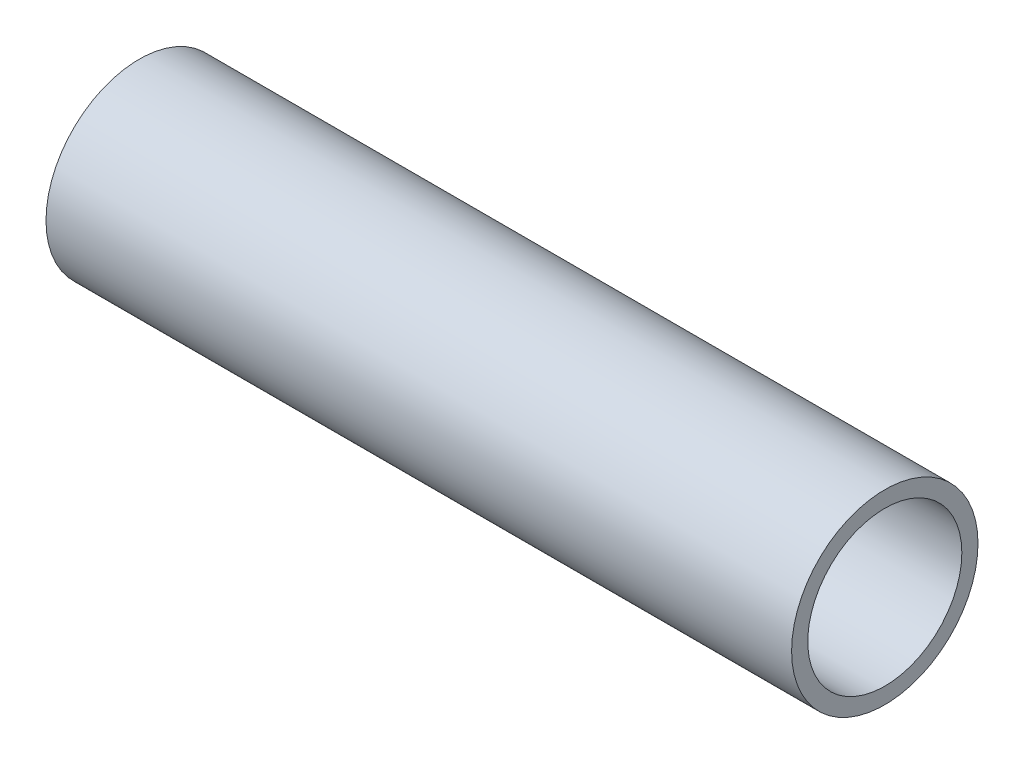
ISO-10303-21;
HEADER;
FILE_DESCRIPTION(('STEP AP214'),'2;1');
FILE_NAME('part.step','',(''),(''),'','','');
FILE_SCHEMA(('AUTOMOTIVE_DESIGN { 1 0 10303 214 1 1 1 1 }'));
ENDSEC;
DATA;
#1=APPLICATION_CONTEXT('core data for automotive mechanical design processes');
#2=APPLICATION_PROTOCOL_DEFINITION('international standard','automotive_design',2000,#1);
#3=PRODUCT_CONTEXT('',#1,'mechanical');
#4=PRODUCT('Part','Part','',(#3));
#5=PRODUCT_RELATED_PRODUCT_CATEGORY('part','',(#4));
#6=PRODUCT_DEFINITION_FORMATION('','',#4);
#7=PRODUCT_DEFINITION_CONTEXT('part definition',#1,'design');
#8=PRODUCT_DEFINITION('design','',#6,#7);
#9=PRODUCT_DEFINITION_SHAPE('','',#8);
#10=(LENGTH_UNIT() NAMED_UNIT(*) SI_UNIT(.MILLI.,.METRE.));
#11=(NAMED_UNIT(*) PLANE_ANGLE_UNIT() SI_UNIT($,.RADIAN.));
#12=(NAMED_UNIT(*) SI_UNIT($,.STERADIAN.) SOLID_ANGLE_UNIT());
#13=UNCERTAINTY_MEASURE_WITH_UNIT(LENGTH_MEASURE(1.E-05),#10,'distance_accuracy_value','');
#14=(GEOMETRIC_REPRESENTATION_CONTEXT(3) GLOBAL_UNCERTAINTY_ASSIGNED_CONTEXT((#13)) GLOBAL_UNIT_ASSIGNED_CONTEXT((#10,
#11,#12)) REPRESENTATION_CONTEXT('',''));
#15=CARTESIAN_POINT('',(0.,0.,0.));
#16=DIRECTION('',(0.,0.,1.));
#17=DIRECTION('',(1.,0.,0.));
#18=AXIS2_PLACEMENT_3D('',#15,#16,#17);
#19=CARTESIAN_POINT('',(38.1,0.,0.));
#20=DIRECTION('',(1.,0.,0.));
#21=DIRECTION('',(0.,0.,-1.));
#22=AXIS2_PLACEMENT_3D('',#19,#20,#21);
#23=PLANE('',#22);
#24=CARTESIAN_POINT('',(38.1,0.,0.));
#25=DIRECTION('',(1.,0.,0.));
#26=DIRECTION('',(0.,0.,-1.));
#27=AXIS2_PLACEMENT_3D('',#24,#25,#26);
#28=CIRCLE('',#27,9.525);
#29=CARTESIAN_POINT('',(38.1,0.,-9.525));
#30=VERTEX_POINT('',#29);
#31=EDGE_CURVE('E10',#30,#30,#28,.T.);
#32=ORIENTED_EDGE('',*,*,#31,.T.);
#33=EDGE_LOOP('',(#32));
#34=FACE_BOUND('',#33,.T.);
#35=CARTESIAN_POINT('',(38.1,0.,0.));
#36=DIRECTION('',(1.,0.,0.));
#37=DIRECTION('',(0.,0.,-1.));
#38=AXIS2_PLACEMENT_3D('',#35,#36,#37);
#39=CIRCLE('',#38,7.874);
#40=CARTESIAN_POINT('',(38.1,0.,-7.874));
#41=VERTEX_POINT('',#40);
#42=EDGE_CURVE('E42',#41,#41,#39,.T.);
#43=ORIENTED_EDGE('',*,*,#42,.F.);
#44=EDGE_LOOP('',(#43));
#45=FACE_BOUND('',#44,.T.);
#46=ADVANCED_FACE('F31',(#34,#45),#23,.T.);
#47=CARTESIAN_POINT('',(-38.1,0.,0.));
#48=DIRECTION('',(1.,0.,0.));
#49=DIRECTION('',(0.,0.,-1.));
#50=AXIS2_PLACEMENT_3D('',#47,#48,#49);
#51=PLANE('',#50);
#52=CARTESIAN_POINT('',(-38.1,0.,0.));
#53=DIRECTION('',(1.,0.,0.));
#54=DIRECTION('',(0.,0.,-1.));
#55=AXIS2_PLACEMENT_3D('',#52,#53,#54);
#56=CIRCLE('',#55,9.525);
#57=CARTESIAN_POINT('',(-38.1,0.,-9.525));
#58=VERTEX_POINT('',#57);
#59=EDGE_CURVE('E35',#58,#58,#56,.T.);
#60=ORIENTED_EDGE('',*,*,#59,.F.);
#61=EDGE_LOOP('',(#60));
#62=FACE_BOUND('',#61,.T.);
#63=CARTESIAN_POINT('',(-38.1,0.,0.));
#64=DIRECTION('',(1.,0.,0.));
#65=DIRECTION('',(0.,0.,-1.));
#66=AXIS2_PLACEMENT_3D('',#63,#64,#65);
#67=CIRCLE('',#66,7.874);
#68=CARTESIAN_POINT('',(-38.1,0.,-7.874));
#69=VERTEX_POINT('',#68);
#70=EDGE_CURVE('E44',#69,#69,#67,.T.);
#71=ORIENTED_EDGE('',*,*,#70,.T.);
#72=EDGE_LOOP('',(#71));
#73=FACE_BOUND('',#72,.T.);
#74=ADVANCED_FACE('F54',(#62,#73),#51,.F.);
#75=CARTESIAN_POINT('',(38.1,0.,0.));
#76=DIRECTION('',(-1.,0.,0.));
#77=DIRECTION('',(0.,0.,1.));
#78=AXIS2_PLACEMENT_3D('',#75,#76,#77);
#79=CYLINDRICAL_SURFACE('',#78,9.525);
#80=ORIENTED_EDGE('',*,*,#31,.F.);
#81=EDGE_LOOP('',(#80));
#82=FACE_BOUND('',#81,.T.);
#83=ORIENTED_EDGE('',*,*,#59,.T.);
#84=EDGE_LOOP('',(#83));
#85=FACE_BOUND('',#84,.T.);
#86=ADVANCED_FACE('F33',(#82,#85),#79,.T.);
#87=CARTESIAN_POINT('',(38.1,0.,0.));
#88=DIRECTION('',(-1.,0.,0.));
#89=DIRECTION('',(0.,0.,1.));
#90=AXIS2_PLACEMENT_3D('',#87,#88,#89);
#91=CYLINDRICAL_SURFACE('',#90,7.874);
#92=ORIENTED_EDGE('',*,*,#42,.T.);
#93=EDGE_LOOP('',(#92));
#94=FACE_BOUND('',#93,.T.);
#95=ORIENTED_EDGE('',*,*,#70,.F.);
#96=EDGE_LOOP('',(#95));
#97=FACE_BOUND('',#96,.T.);
#98=ADVANCED_FACE('F50',(#94,#97),#91,.F.);
#99=CLOSED_SHELL('',(#46,#74,#86,#98));
#100=MANIFOLD_SOLID_BREP('B2',#99);
#101=ADVANCED_BREP_SHAPE_REPRESENTATION('',(#18,#100),#14);
#102=SHAPE_DEFINITION_REPRESENTATION(#9,#101);
ENDSEC;
END-ISO-10303-21;
